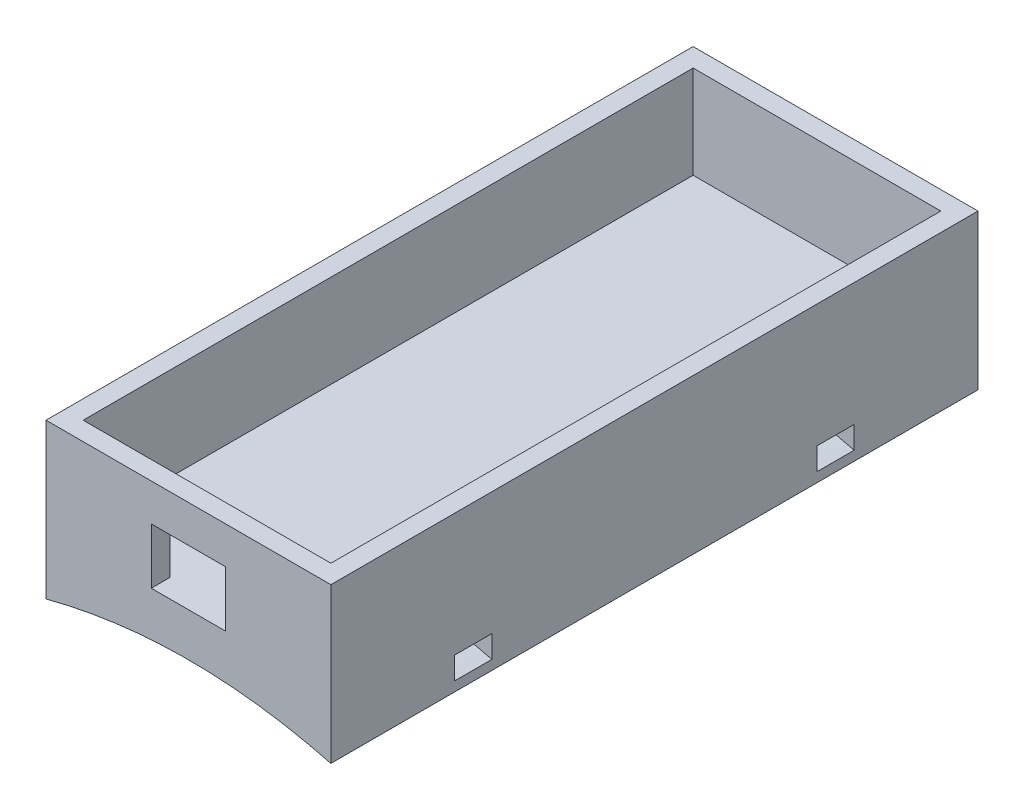
ISO-10303-21;
HEADER;
FILE_DESCRIPTION(('STEP AP214'),'2;1');
FILE_NAME('part.step','',(''),(''),'','','');
FILE_SCHEMA(('AUTOMOTIVE_DESIGN { 1 0 10303 214 1 1 1 1 }'));
ENDSEC;
DATA;
#1=APPLICATION_CONTEXT('core data for automotive mechanical design processes');
#2=APPLICATION_PROTOCOL_DEFINITION('international standard','automotive_design',2000,#1);
#3=PRODUCT_CONTEXT('',#1,'mechanical');
#4=PRODUCT('Part','Part','',(#3));
#5=PRODUCT_RELATED_PRODUCT_CATEGORY('part','',(#4));
#6=PRODUCT_DEFINITION_FORMATION('','',#4);
#7=PRODUCT_DEFINITION_CONTEXT('part definition',#1,'design');
#8=PRODUCT_DEFINITION('design','',#6,#7);
#9=PRODUCT_DEFINITION_SHAPE('','',#8);
#10=(LENGTH_UNIT() NAMED_UNIT(*) SI_UNIT(.MILLI.,.METRE.));
#11=(NAMED_UNIT(*) PLANE_ANGLE_UNIT() SI_UNIT($,.RADIAN.));
#12=(NAMED_UNIT(*) SI_UNIT($,.STERADIAN.) SOLID_ANGLE_UNIT());
#13=UNCERTAINTY_MEASURE_WITH_UNIT(LENGTH_MEASURE(1.E-05),#10,'distance_accuracy_value','');
#14=(GEOMETRIC_REPRESENTATION_CONTEXT(3) GLOBAL_UNCERTAINTY_ASSIGNED_CONTEXT((#13)) GLOBAL_UNIT_ASSIGNED_CONTEXT((#10,
#11,#12)) REPRESENTATION_CONTEXT('',''));
#15=CARTESIAN_POINT('',(0.,0.,0.));
#16=DIRECTION('',(0.,0.,1.));
#17=DIRECTION('',(1.,0.,0.));
#18=AXIS2_PLACEMENT_3D('',#15,#16,#17);
#19=CARTESIAN_POINT('',(-1.5,7.5,0.));
#20=DIRECTION('',(-1.,0.,0.));
#21=DIRECTION('',(0.,0.,1.));
#22=AXIS2_PLACEMENT_3D('',#19,#20,#21);
#23=PLANE('',#22);
#24=DIRECTION('',(0.,-1.,0.));
#25=VECTOR('',#24,1.);
#26=CARTESIAN_POINT('',(-1.5,7.5,-51.5));
#27=LINE('',#26,#25);
#28=CARTESIAN_POINT('',(-1.5,7.5,-51.5));
#29=VERTEX_POINT('',#28);
#30=CARTESIAN_POINT('',(-1.5,-5.,-51.5));
#31=VERTEX_POINT('',#30);
#32=EDGE_CURVE('E11',#29,#31,#27,.T.);
#33=ORIENTED_EDGE('',*,*,#32,.T.);
#34=DIRECTION('',(0.,0.,-1.));
#35=VECTOR('',#34,1.);
#36=CARTESIAN_POINT('',(-1.5,-5.,-51.5));
#37=LINE('',#36,#35);
#38=CARTESIAN_POINT('',(-1.5,-5.,0.750000000000001));
#39=VERTEX_POINT('',#38);
#40=EDGE_CURVE('E346',#39,#31,#37,.T.);
#41=ORIENTED_EDGE('',*,*,#40,.F.);
#42=DIRECTION('',(0.,-1.,0.));
#43=VECTOR('',#42,1.);
#44=CARTESIAN_POINT('',(-1.5,7.5,0.75));
#45=LINE('',#44,#43);
#46=CARTESIAN_POINT('',(-1.5,7.5,0.75));
#47=VERTEX_POINT('',#46);
#48=EDGE_CURVE('E51',#47,#39,#45,.T.);
#49=ORIENTED_EDGE('',*,*,#48,.F.);
#50=DIRECTION('',(0.,0.,-1.));
#51=VECTOR('',#50,1.);
#52=CARTESIAN_POINT('',(-1.5,7.5,0.));
#53=LINE('',#52,#51);
#54=EDGE_CURVE('E375',#47,#29,#53,.T.);
#55=ORIENTED_EDGE('',*,*,#54,.T.);
#56=EDGE_LOOP('',(#33,#41,#49,#55));
#57=FACE_BOUND('',#56,.T.);
#58=DIRECTION('',(0.,0.,-1.));
#59=VECTOR('',#58,1.);
#60=CARTESIAN_POINT('',(-1.49999999932235,-2.42062921537259,-38.5));
#61=LINE('',#60,#59);
#62=CARTESIAN_POINT('',(-1.49999999932235,-2.42062921537259,-38.5));
#63=VERTEX_POINT('',#62);
#64=CARTESIAN_POINT('',(-1.5,-2.4206292153726,-41.5));
#65=VERTEX_POINT('',#64);
#66=EDGE_CURVE('E694',#63,#65,#61,.T.);
#67=ORIENTED_EDGE('',*,*,#66,.F.);
#68=DIRECTION('',(2.62720537790411E-10,1.,0.));
#69=VECTOR('',#68,1.);
#70=CARTESIAN_POINT('',(-1.4999999986864,3.94080806340506E-10,-38.5));
#71=LINE('',#70,#69);
#72=CARTESIAN_POINT('',(-1.49999999979647,-4.22530562538644,-38.5));
#73=VERTEX_POINT('',#72);
#74=EDGE_CURVE('E264',#73,#63,#71,.T.);
#75=ORIENTED_EDGE('',*,*,#74,.F.);
#76=DIRECTION('',(0.,0.,-1.));
#77=VECTOR('',#76,1.);
#78=CARTESIAN_POINT('',(-1.49999999979647,-4.22530562538644,-38.5));
#79=LINE('',#78,#77);
#80=CARTESIAN_POINT('',(-1.49999999979647,-4.22530562538644,-41.5));
#81=VERTEX_POINT('',#80);
#82=EDGE_CURVE('E291',#73,#81,#79,.T.);
#83=ORIENTED_EDGE('',*,*,#82,.T.);
#84=DIRECTION('',(2.62720537790411E-10,1.,0.));
#85=VECTOR('',#84,1.);
#86=CARTESIAN_POINT('',(-1.4999999986864,3.94080806340506E-10,-41.5));
#87=LINE('',#86,#85);
#88=EDGE_CURVE('E673',#81,#65,#87,.T.);
#89=ORIENTED_EDGE('',*,*,#88,.T.);
#90=EDGE_LOOP('',(#67,#75,#83,#89));
#91=FACE_BOUND('',#90,.T.);
#92=DIRECTION('',(0.,0.,-1.));
#93=VECTOR('',#92,1.);
#94=CARTESIAN_POINT('',(-1.50000000404462,-4.22530560882838,-10.75));
#95=LINE('',#94,#93);
#96=CARTESIAN_POINT('',(-1.50000000404462,-4.22530560882838,-12.25));
#97=VERTEX_POINT('',#96);
#98=CARTESIAN_POINT('',(-1.5,-4.22530560882838,-9.25));
#99=VERTEX_POINT('',#98);
#100=EDGE_CURVE('E200',#97,#99,#95,.F.);
#101=ORIENTED_EDGE('',*,*,#100,.F.);
#102=DIRECTION('',(-2.61668753361445E-09,-1.,0.));
#103=VECTOR('',#102,1.);
#104=CARTESIAN_POINT('',(-1.49999999932235,-2.42062921537259,-12.25));
#105=LINE('',#104,#103);
#106=CARTESIAN_POINT('',(-1.49999999932234,-2.42062921537258,-12.25));
#107=VERTEX_POINT('',#106);
#108=EDGE_CURVE('E198',#107,#97,#105,.T.);
#109=ORIENTED_EDGE('',*,*,#108,.F.);
#110=DIRECTION('',(0.,0.,-1.));
#111=VECTOR('',#110,1.);
#112=CARTESIAN_POINT('',(-1.49999999932234,-2.42062921537258,-10.75));
#113=LINE('',#112,#111);
#114=CARTESIAN_POINT('',(-1.49999999932234,-2.42062921537258,-9.25000000000001));
#115=VERTEX_POINT('',#114);
#116=EDGE_CURVE('E180',#107,#115,#113,.F.);
#117=ORIENTED_EDGE('',*,*,#116,.T.);
#118=DIRECTION('',(-2.61668753361445E-09,-1.,0.));
#119=VECTOR('',#118,1.);
#120=CARTESIAN_POINT('',(-1.49999999932235,-2.42062921537259,-9.25));
#121=LINE('',#120,#119);
#122=EDGE_CURVE('E186',#115,#99,#121,.T.);
#123=ORIENTED_EDGE('',*,*,#122,.T.);
#124=EDGE_LOOP('',(#101,#109,#117,#123));
#125=FACE_BOUND('',#124,.T.);
#126=ADVANCED_FACE('F41',(#57,#91,#125),#23,.T.);
#127=CARTESIAN_POINT('',(21.5,7.5,0.));
#128=DIRECTION('',(1.,0.,0.));
#129=DIRECTION('',(0.,0.,-1.));
#130=AXIS2_PLACEMENT_3D('',#127,#128,#129);
#131=PLANE('',#130);
#132=DIRECTION('',(0.,-1.,0.));
#133=VECTOR('',#132,1.);
#134=CARTESIAN_POINT('',(21.5,7.5,0.75));
#135=LINE('',#134,#133);
#136=CARTESIAN_POINT('',(21.5,7.5,0.75));
#137=VERTEX_POINT('',#136);
#138=CARTESIAN_POINT('',(21.5,-5.,0.750000000000001));
#139=VERTEX_POINT('',#138);
#140=EDGE_CURVE('E405',#137,#139,#135,.T.);
#141=ORIENTED_EDGE('',*,*,#140,.T.);
#142=DIRECTION('',(0.,0.,1.));
#143=VECTOR('',#142,1.);
#144=CARTESIAN_POINT('',(21.5,-5.,-51.5));
#145=LINE('',#144,#143);
#146=CARTESIAN_POINT('',(21.5,-5.,-51.5));
#147=VERTEX_POINT('',#146);
#148=EDGE_CURVE('E422',#147,#139,#145,.T.);
#149=ORIENTED_EDGE('',*,*,#148,.F.);
#150=DIRECTION('',(0.,-1.,0.));
#151=VECTOR('',#150,1.);
#152=CARTESIAN_POINT('',(21.5,7.5,-51.5));
#153=LINE('',#152,#151);
#154=CARTESIAN_POINT('',(21.5,7.5,-51.5));
#155=VERTEX_POINT('',#154);
#156=EDGE_CURVE('E402',#155,#147,#153,.T.);
#157=ORIENTED_EDGE('',*,*,#156,.F.);
#158=DIRECTION('',(0.,0.,1.));
#159=VECTOR('',#158,1.);
#160=CARTESIAN_POINT('',(21.5,7.5,0.));
#161=LINE('',#160,#159);
#162=EDGE_CURVE('E382',#155,#137,#161,.T.);
#163=ORIENTED_EDGE('',*,*,#162,.T.);
#164=EDGE_LOOP('',(#141,#149,#157,#163));
#165=FACE_BOUND('',#164,.T.);
#166=DIRECTION('',(0.,0.,-1.));
#167=VECTOR('',#166,1.);
#168=CARTESIAN_POINT('',(21.4999999997962,-4.22530562538759,-38.5));
#169=LINE('',#168,#167);
#170=CARTESIAN_POINT('',(21.4999999997962,-4.22530562538759,-38.5));
#171=VERTEX_POINT('',#170);
#172=CARTESIAN_POINT('',(21.5,-4.22530562538759,-41.5));
#173=VERTEX_POINT('',#172);
#174=EDGE_CURVE('E302',#171,#173,#169,.T.);
#175=ORIENTED_EDGE('',*,*,#174,.F.);
#176=DIRECTION('',(-2.63069752866521E-10,1.,0.));
#177=VECTOR('',#176,1.);
#178=CARTESIAN_POINT('',(21.4999999986847,5.65599968628418E-09,-38.5));
#179=LINE('',#178,#177);
#180=CARTESIAN_POINT('',(21.4999999993214,-2.42062921537248,-38.5));
#181=VERTEX_POINT('',#180);
#182=EDGE_CURVE('E699',#171,#181,#179,.T.);
#183=ORIENTED_EDGE('',*,*,#182,.T.);
#184=DIRECTION('',(0.,0.,-1.));
#185=VECTOR('',#184,1.);
#186=CARTESIAN_POINT('',(21.4999999993214,-2.42062921537248,-38.5));
#187=LINE('',#186,#185);
#188=CARTESIAN_POINT('',(21.4999999993214,-2.42062921537248,-41.5));
#189=VERTEX_POINT('',#188);
#190=EDGE_CURVE('E681',#181,#189,#187,.T.);
#191=ORIENTED_EDGE('',*,*,#190,.T.);
#192=DIRECTION('',(-2.63069752866521E-10,1.,0.));
#193=VECTOR('',#192,1.);
#194=CARTESIAN_POINT('',(21.4999999986847,5.65599968628418E-09,-41.5));
#195=LINE('',#194,#193);
#196=EDGE_CURVE('E265',#173,#189,#195,.T.);
#197=ORIENTED_EDGE('',*,*,#196,.F.);
#198=EDGE_LOOP('',(#175,#183,#191,#197));
#199=FACE_BOUND('',#198,.T.);
#200=DIRECTION('',(0.,0.,-1.));
#201=VECTOR('',#200,1.);
#202=CARTESIAN_POINT('',(21.4999999993214,-2.42062921537248,-10.75));
#203=LINE('',#202,#201);
#204=CARTESIAN_POINT('',(21.4999999993214,-2.42062921537248,-12.25));
#205=VERTEX_POINT('',#204);
#206=CARTESIAN_POINT('',(21.5,-2.42062921537248,-9.25));
#207=VERTEX_POINT('',#206);
#208=EDGE_CURVE('E183',#205,#207,#203,.F.);
#209=ORIENTED_EDGE('',*,*,#208,.F.);
#210=DIRECTION('',(-2.61722414471187E-09,1.,0.));
#211=VECTOR('',#210,1.);
#212=CARTESIAN_POINT('',(21.5000000040447,-4.22530560882845,-12.25));
#213=LINE('',#212,#211);
#214=CARTESIAN_POINT('',(21.5000000040447,-4.22530560882845,-12.25));
#215=VERTEX_POINT('',#214);
#216=EDGE_CURVE('E221',#215,#205,#213,.T.);
#217=ORIENTED_EDGE('',*,*,#216,.F.);
#218=DIRECTION('',(0.,0.,-1.));
#219=VECTOR('',#218,1.);
#220=CARTESIAN_POINT('',(21.5000000040447,-4.22530560882845,-10.75));
#221=LINE('',#220,#219);
#222=CARTESIAN_POINT('',(21.5000000040447,-4.22530560882845,-9.25000000000001));
#223=VERTEX_POINT('',#222);
#224=EDGE_CURVE('E206',#215,#223,#221,.F.);
#225=ORIENTED_EDGE('',*,*,#224,.T.);
#226=DIRECTION('',(-2.61722414471187E-09,1.,0.));
#227=VECTOR('',#226,1.);
#228=CARTESIAN_POINT('',(21.5000000040447,-4.22530560882845,-9.25));
#229=LINE('',#228,#227);
#230=EDGE_CURVE('E187',#223,#207,#229,.T.);
#231=ORIENTED_EDGE('',*,*,#230,.T.);
#232=EDGE_LOOP('',(#209,#217,#225,#231));
#233=FACE_BOUND('',#232,.T.);
#234=ADVANCED_FACE('F452',(#165,#199,#233),#131,.T.);
#235=CARTESIAN_POINT('',(0.,7.5,0.75));
#236=DIRECTION('',(0.,0.,-1.));
#237=DIRECTION('',(-1.,0.,0.));
#238=AXIS2_PLACEMENT_3D('',#235,#236,#237);
#239=PLANE('',#238);
#240=ORIENTED_EDGE('',*,*,#48,.T.);
#241=CARTESIAN_POINT('',(-1.5,-5.,0.750000000000001));
#242=CARTESIAN_POINT('',(10.,-2.,0.750000000000001));
#243=CARTESIAN_POINT('',(21.5,-5.,0.750000000000001));
#244=B_SPLINE_CURVE_WITH_KNOTS('',2,(#241,#242,#243),.UNSPECIFIED.,.F.,.F.,(3,3),(0.,1.),.UNSPECIFIED.);
#245=EDGE_CURVE('E301',#39,#139,#244,.T.);
#246=ORIENTED_EDGE('',*,*,#245,.T.);
#247=ORIENTED_EDGE('',*,*,#140,.F.);
#248=DIRECTION('',(1.,0.,0.));
#249=VECTOR('',#248,1.);
#250=CARTESIAN_POINT('',(0.,7.5,0.75));
#251=LINE('',#250,#249);
#252=EDGE_CURVE('E379',#47,#137,#251,.T.);
#253=ORIENTED_EDGE('',*,*,#252,.F.);
#254=EDGE_LOOP('',(#240,#246,#247,#253));
#255=FACE_BOUND('',#254,.T.);
#256=DIRECTION('',(-1.,0.,0.));
#257=VECTOR('',#256,1.);
#258=CARTESIAN_POINT('',(0.,4.5,0.75));
#259=LINE('',#258,#257);
#260=CARTESIAN_POINT('',(13.,4.5,0.75));
#261=VERTEX_POINT('',#260);
#262=CARTESIAN_POINT('',(7.,4.5,0.75));
#263=VERTEX_POINT('',#262);
#264=EDGE_CURVE('E314',#261,#263,#259,.T.);
#265=ORIENTED_EDGE('',*,*,#264,.F.);
#266=DIRECTION('',(0.,-1.,0.));
#267=VECTOR('',#266,1.);
#268=CARTESIAN_POINT('',(13.,0.,0.75));
#269=LINE('',#268,#267);
#270=CARTESIAN_POINT('',(13.,0.,0.75));
#271=VERTEX_POINT('',#270);
#272=EDGE_CURVE('E320',#261,#271,#269,.T.);
#273=ORIENTED_EDGE('',*,*,#272,.T.);
#274=DIRECTION('',(-1.,0.,0.));
#275=VECTOR('',#274,1.);
#276=CARTESIAN_POINT('',(0.,0.,0.75));
#277=LINE('',#276,#275);
#278=CARTESIAN_POINT('',(7.,0.,0.75));
#279=VERTEX_POINT('',#278);
#280=EDGE_CURVE('E325',#271,#279,#277,.T.);
#281=ORIENTED_EDGE('',*,*,#280,.T.);
#282=DIRECTION('',(0.,-1.,0.));
#283=VECTOR('',#282,1.);
#284=CARTESIAN_POINT('',(7.,0.,0.75));
#285=LINE('',#284,#283);
#286=EDGE_CURVE('E329',#263,#279,#285,.T.);
#287=ORIENTED_EDGE('',*,*,#286,.F.);
#288=EDGE_LOOP('',(#265,#273,#281,#287));
#289=FACE_BOUND('',#288,.T.);
#290=ADVANCED_FACE('F455',(#255,#289),#239,.F.);
#291=CARTESIAN_POINT('',(0.,7.5,-0.75));
#292=DIRECTION('',(0.,0.,-1.));
#293=DIRECTION('',(-1.,0.,0.));
#294=AXIS2_PLACEMENT_3D('',#291,#292,#293);
#295=PLANE('',#294);
#296=DIRECTION('',(-1.,0.,0.));
#297=VECTOR('',#296,1.);
#298=CARTESIAN_POINT('',(0.,4.5,-0.75));
#299=LINE('',#298,#297);
#300=CARTESIAN_POINT('',(13.,4.5,-0.75));
#301=VERTEX_POINT('',#300);
#302=CARTESIAN_POINT('',(7.,4.5,-0.75));
#303=VERTEX_POINT('',#302);
#304=EDGE_CURVE('E309',#301,#303,#299,.T.);
#305=ORIENTED_EDGE('',*,*,#304,.T.);
#306=DIRECTION('',(0.,-1.,0.));
#307=VECTOR('',#306,1.);
#308=CARTESIAN_POINT('',(7.,0.,-0.75));
#309=LINE('',#308,#307);
#310=CARTESIAN_POINT('',(7.,0.,-0.75));
#311=VERTEX_POINT('',#310);
#312=EDGE_CURVE('E321',#303,#311,#309,.T.);
#313=ORIENTED_EDGE('',*,*,#312,.T.);
#314=DIRECTION('',(1.,0.,0.));
#315=VECTOR('',#314,1.);
#316=CARTESIAN_POINT('',(0.,0.,-0.75));
#317=LINE('',#316,#315);
#318=CARTESIAN_POINT('',(0.,0.,-0.75));
#319=VERTEX_POINT('',#318);
#320=EDGE_CURVE('E387',#319,#311,#317,.T.);
#321=ORIENTED_EDGE('',*,*,#320,.F.);
#322=DIRECTION('',(0.,-1.,0.));
#323=VECTOR('',#322,1.);
#324=CARTESIAN_POINT('',(0.,7.5,-0.75));
#325=LINE('',#324,#323);
#326=CARTESIAN_POINT('',(0.,7.5,-0.75));
#327=VERTEX_POINT('',#326);
#328=EDGE_CURVE('E406',#327,#319,#325,.T.);
#329=ORIENTED_EDGE('',*,*,#328,.F.);
#330=DIRECTION('',(1.,0.,0.));
#331=VECTOR('',#330,1.);
#332=CARTESIAN_POINT('',(0.,7.5,-0.75));
#333=LINE('',#332,#331);
#334=CARTESIAN_POINT('',(20.,7.5,-0.75));
#335=VERTEX_POINT('',#334);
#336=EDGE_CURVE('E356',#327,#335,#333,.T.);
#337=ORIENTED_EDGE('',*,*,#336,.T.);
#338=DIRECTION('',(0.,-1.,0.));
#339=VECTOR('',#338,1.);
#340=CARTESIAN_POINT('',(20.,7.5,-0.75));
#341=LINE('',#340,#339);
#342=CARTESIAN_POINT('',(20.,0.,-0.75));
#343=VERTEX_POINT('',#342);
#344=EDGE_CURVE('E386',#335,#343,#341,.T.);
#345=ORIENTED_EDGE('',*,*,#344,.T.);
#346=CARTESIAN_POINT('',(13.,0.,-0.75));
#347=VERTEX_POINT('',#346);
#348=EDGE_CURVE('E392',#347,#343,#317,.T.);
#349=ORIENTED_EDGE('',*,*,#348,.F.);
#350=DIRECTION('',(0.,-1.,0.));
#351=VECTOR('',#350,1.);
#352=CARTESIAN_POINT('',(13.,0.,-0.75));
#353=LINE('',#352,#351);
#354=EDGE_CURVE('E336',#301,#347,#353,.T.);
#355=ORIENTED_EDGE('',*,*,#354,.F.);
#356=EDGE_LOOP('',(#305,#313,#321,#329,#337,#345,#349,#355));
#357=FACE_BOUND('',#356,.T.);
#358=ADVANCED_FACE('F43',(#357),#295,.T.);
#359=CARTESIAN_POINT('',(0.,7.5,-51.5));
#360=DIRECTION('',(0.,0.,-1.));
#361=DIRECTION('',(-1.,0.,0.));
#362=AXIS2_PLACEMENT_3D('',#359,#360,#361);
#363=PLANE('',#362);
#364=CARTESIAN_POINT('',(-1.5,-5.,-51.5));
#365=CARTESIAN_POINT('',(10.,-2.,-51.5));
#366=CARTESIAN_POINT('',(21.5,-5.,-51.5));
#367=B_SPLINE_CURVE_WITH_KNOTS('',2,(#364,#365,#366),.UNSPECIFIED.,.F.,.F.,(3,3),(0.,1.),.UNSPECIFIED.);
#368=EDGE_CURVE('E293',#31,#147,#367,.T.);
#369=ORIENTED_EDGE('',*,*,#368,.F.);
#370=ORIENTED_EDGE('',*,*,#32,.F.);
#371=DIRECTION('',(1.,0.,0.));
#372=VECTOR('',#371,1.);
#373=CARTESIAN_POINT('',(0.,7.5,-51.5));
#374=LINE('',#373,#372);
#375=EDGE_CURVE('E371',#29,#155,#374,.T.);
#376=ORIENTED_EDGE('',*,*,#375,.T.);
#377=ORIENTED_EDGE('',*,*,#156,.T.);
#378=EDGE_LOOP('',(#369,#370,#376,#377));
#379=FACE_BOUND('',#378,.T.);
#380=ADVANCED_FACE('F441',(#379),#363,.T.);
#381=CARTESIAN_POINT('',(0.,7.5,0.));
#382=DIRECTION('',(-1.,0.,0.));
#383=DIRECTION('',(0.,0.,1.));
#384=AXIS2_PLACEMENT_3D('',#381,#382,#383);
#385=PLANE('',#384);
#386=DIRECTION('',(0.,0.,-1.));
#387=VECTOR('',#386,1.);
#388=CARTESIAN_POINT('',(0.,0.,0.));
#389=LINE('',#388,#387);
#390=CARTESIAN_POINT('',(0.,0.,-50.));
#391=VERTEX_POINT('',#390);
#392=EDGE_CURVE('E391',#319,#391,#389,.T.);
#393=ORIENTED_EDGE('',*,*,#392,.T.);
#394=DIRECTION('',(0.,-1.,0.));
#395=VECTOR('',#394,1.);
#396=CARTESIAN_POINT('',(0.,7.5,-50.));
#397=LINE('',#396,#395);
#398=CARTESIAN_POINT('',(0.,7.5,-50.));
#399=VERTEX_POINT('',#398);
#400=EDGE_CURVE('E415',#399,#391,#397,.T.);
#401=ORIENTED_EDGE('',*,*,#400,.F.);
#402=DIRECTION('',(0.,0.,-1.));
#403=VECTOR('',#402,1.);
#404=CARTESIAN_POINT('',(0.,7.5,0.));
#405=LINE('',#404,#403);
#406=EDGE_CURVE('E360',#327,#399,#405,.T.);
#407=ORIENTED_EDGE('',*,*,#406,.F.);
#408=ORIENTED_EDGE('',*,*,#328,.T.);
#409=EDGE_LOOP('',(#393,#401,#407,#408));
#410=FACE_BOUND('',#409,.T.);
#411=ADVANCED_FACE('F476',(#410),#385,.F.);
#412=CARTESIAN_POINT('',(0.,7.5,-50.));
#413=DIRECTION('',(0.,0.,-1.));
#414=DIRECTION('',(-1.,0.,0.));
#415=AXIS2_PLACEMENT_3D('',#412,#413,#414);
#416=PLANE('',#415);
#417=DIRECTION('',(1.,0.,0.));
#418=VECTOR('',#417,1.);
#419=CARTESIAN_POINT('',(0.,0.,-50.));
#420=LINE('',#419,#418);
#421=CARTESIAN_POINT('',(20.,0.,-50.));
#422=VERTEX_POINT('',#421);
#423=EDGE_CURVE('E396',#391,#422,#420,.T.);
#424=ORIENTED_EDGE('',*,*,#423,.T.);
#425=DIRECTION('',(0.,-1.,0.));
#426=VECTOR('',#425,1.);
#427=CARTESIAN_POINT('',(20.,7.5,-50.));
#428=LINE('',#427,#426);
#429=CARTESIAN_POINT('',(20.,7.5,-50.));
#430=VERTEX_POINT('',#429);
#431=EDGE_CURVE('E411',#430,#422,#428,.T.);
#432=ORIENTED_EDGE('',*,*,#431,.F.);
#433=DIRECTION('',(1.,0.,0.));
#434=VECTOR('',#433,1.);
#435=CARTESIAN_POINT('',(0.,7.5,-50.));
#436=LINE('',#435,#434);
#437=EDGE_CURVE('E364',#399,#430,#436,.T.);
#438=ORIENTED_EDGE('',*,*,#437,.F.);
#439=ORIENTED_EDGE('',*,*,#400,.T.);
#440=EDGE_LOOP('',(#424,#432,#438,#439));
#441=FACE_BOUND('',#440,.T.);
#442=ADVANCED_FACE('F505',(#441),#416,.F.);
#443=CARTESIAN_POINT('',(20.,7.5,0.));
#444=DIRECTION('',(-1.,0.,0.));
#445=DIRECTION('',(0.,0.,1.));
#446=AXIS2_PLACEMENT_3D('',#443,#444,#445);
#447=PLANE('',#446);
#448=DIRECTION('',(0.,0.,-1.));
#449=VECTOR('',#448,1.);
#450=CARTESIAN_POINT('',(20.,0.,0.));
#451=LINE('',#450,#449);
#452=EDGE_CURVE('E361',#343,#422,#451,.T.);
#453=ORIENTED_EDGE('',*,*,#452,.F.);
#454=ORIENTED_EDGE('',*,*,#344,.F.);
#455=DIRECTION('',(0.,0.,-1.));
#456=VECTOR('',#455,1.);
#457=CARTESIAN_POINT('',(20.,7.5,0.));
#458=LINE('',#457,#456);
#459=EDGE_CURVE('E367',#335,#430,#458,.T.);
#460=ORIENTED_EDGE('',*,*,#459,.T.);
#461=ORIENTED_EDGE('',*,*,#431,.T.);
#462=EDGE_LOOP('',(#453,#454,#460,#461));
#463=FACE_BOUND('',#462,.T.);
#464=ADVANCED_FACE('F485',(#463),#447,.T.);
#465=CARTESIAN_POINT('',(0.,7.5,0.));
#466=DIRECTION('',(0.,1.,0.));
#467=DIRECTION('',(0.,0.,1.));
#468=AXIS2_PLACEMENT_3D('',#465,#466,#467);
#469=PLANE('',#468);
#470=ORIENTED_EDGE('',*,*,#336,.F.);
#471=ORIENTED_EDGE('',*,*,#406,.T.);
#472=ORIENTED_EDGE('',*,*,#437,.T.);
#473=ORIENTED_EDGE('',*,*,#459,.F.);
#474=EDGE_LOOP('',(#470,#471,#472,#473));
#475=FACE_BOUND('',#474,.T.);
#476=ORIENTED_EDGE('',*,*,#375,.F.);
#477=ORIENTED_EDGE('',*,*,#54,.F.);
#478=ORIENTED_EDGE('',*,*,#252,.T.);
#479=ORIENTED_EDGE('',*,*,#162,.F.);
#480=EDGE_LOOP('',(#476,#477,#478,#479));
#481=FACE_BOUND('',#480,.T.);
#482=ADVANCED_FACE('F448',(#475,#481),#469,.T.);
#483=CARTESIAN_POINT('',(0.,0.,0.));
#484=DIRECTION('',(0.,1.,0.));
#485=DIRECTION('',(0.,0.,1.));
#486=AXIS2_PLACEMENT_3D('',#483,#484,#485);
#487=PLANE('',#486);
#488=ORIENTED_EDGE('',*,*,#392,.F.);
#489=ORIENTED_EDGE('',*,*,#320,.T.);
#490=DIRECTION('',(0.,0.,-1.));
#491=VECTOR('',#490,1.);
#492=CARTESIAN_POINT('',(7.,0.,0.75));
#493=LINE('',#492,#491);
#494=EDGE_CURVE('E347',#279,#311,#493,.T.);
#495=ORIENTED_EDGE('',*,*,#494,.F.);
#496=ORIENTED_EDGE('',*,*,#280,.F.);
#497=DIRECTION('',(0.,0.,-1.));
#498=VECTOR('',#497,1.);
#499=CARTESIAN_POINT('',(13.,0.,0.75));
#500=LINE('',#499,#498);
#501=EDGE_CURVE('E350',#271,#347,#500,.T.);
#502=ORIENTED_EDGE('',*,*,#501,.T.);
#503=ORIENTED_EDGE('',*,*,#348,.T.);
#504=ORIENTED_EDGE('',*,*,#452,.T.);
#505=ORIENTED_EDGE('',*,*,#423,.F.);
#506=EDGE_LOOP('',(#488,#489,#495,#496,#502,#503,#504,#505));
#507=FACE_BOUND('',#506,.T.);
#508=ADVANCED_FACE('F472',(#507),#487,.T.);
#509=CARTESIAN_POINT('',(0.,4.5,0.75));
#510=DIRECTION('',(0.,-1.,0.));
#511=DIRECTION('',(0.,0.,-1.));
#512=AXIS2_PLACEMENT_3D('',#509,#510,#511);
#513=PLANE('',#512);
#514=ORIENTED_EDGE('',*,*,#304,.F.);
#515=DIRECTION('',(0.,0.,-1.));
#516=VECTOR('',#515,1.);
#517=CARTESIAN_POINT('',(13.,4.5,0.75));
#518=LINE('',#517,#516);
#519=EDGE_CURVE('E332',#261,#301,#518,.T.);
#520=ORIENTED_EDGE('',*,*,#519,.F.);
#521=ORIENTED_EDGE('',*,*,#264,.T.);
#522=DIRECTION('',(0.,0.,-1.));
#523=VECTOR('',#522,1.);
#524=CARTESIAN_POINT('',(7.,4.5,0.75));
#525=LINE('',#524,#523);
#526=EDGE_CURVE('E342',#263,#303,#525,.T.);
#527=ORIENTED_EDGE('',*,*,#526,.T.);
#528=EDGE_LOOP('',(#514,#520,#521,#527));
#529=FACE_BOUND('',#528,.T.);
#530=ADVANCED_FACE('F465',(#529),#513,.T.);
#531=CARTESIAN_POINT('',(7.,0.,0.75));
#532=DIRECTION('',(1.,0.,0.));
#533=DIRECTION('',(0.,0.,-1.));
#534=AXIS2_PLACEMENT_3D('',#531,#532,#533);
#535=PLANE('',#534);
#536=ORIENTED_EDGE('',*,*,#312,.F.);
#537=ORIENTED_EDGE('',*,*,#526,.F.);
#538=ORIENTED_EDGE('',*,*,#286,.T.);
#539=ORIENTED_EDGE('',*,*,#494,.T.);
#540=EDGE_LOOP('',(#536,#537,#538,#539));
#541=FACE_BOUND('',#540,.T.);
#542=ADVANCED_FACE('F284',(#541),#535,.T.);
#543=CARTESIAN_POINT('',(13.,0.,0.75));
#544=DIRECTION('',(1.,0.,0.));
#545=DIRECTION('',(0.,0.,-1.));
#546=AXIS2_PLACEMENT_3D('',#543,#544,#545);
#547=PLANE('',#546);
#548=ORIENTED_EDGE('',*,*,#354,.T.);
#549=ORIENTED_EDGE('',*,*,#501,.F.);
#550=ORIENTED_EDGE('',*,*,#272,.F.);
#551=ORIENTED_EDGE('',*,*,#519,.T.);
#552=EDGE_LOOP('',(#548,#549,#550,#551));
#553=FACE_BOUND('',#552,.T.);
#554=ADVANCED_FACE('F282',(#553),#547,.F.);
#555=CARTESIAN_POINT('',(-1.5,-5.,21.));
#556=CARTESIAN_POINT('',(10.,-2.,21.));
#557=CARTESIAN_POINT('',(21.5,-5.,21.));
#558=B_SPLINE_CURVE_WITH_KNOTS('',2,(#555,#556,#557),.UNSPECIFIED.,.F.,.F.,(3,3),(0.,1.),.UNSPECIFIED.);
#559=DIRECTION('',(0.,0.,-1.));
#560=VECTOR('',#559,1.);
#561=SURFACE_OF_LINEAR_EXTRUSION('',#558,#560);
#562=ORIENTED_EDGE('',*,*,#40,.T.);
#563=ORIENTED_EDGE('',*,*,#368,.T.);
#564=ORIENTED_EDGE('',*,*,#148,.T.);
#565=ORIENTED_EDGE('',*,*,#245,.F.);
#566=EDGE_LOOP('',(#562,#563,#564,#565));
#567=FACE_BOUND('',#566,.T.);
#568=ADVANCED_FACE('F276',(#567),#561,.F.);
#569=CARTESIAN_POINT('',(-1.68931642286076,-4.27428704567651,-38.5));
#570=CARTESIAN_POINT('',(-0.723177072021427,-4.02225069328363,-38.5));
#571=CARTESIAN_POINT('',(1.23384065931098,-3.57518255436494,-38.5));
#572=CARTESIAN_POINT('',(5.12508120919202,-2.94122991223732,-38.5));
#573=CARTESIAN_POINT('',(10.0000000000095,-2.62251339179796,-38.5));
#574=CARTESIAN_POINT('',(14.8749187908227,-2.94122991223914,-38.5));
#575=CARTESIAN_POINT('',(18.7661593407068,-3.57518255436815,-38.5));
#576=CARTESIAN_POINT('',(20.7231770720375,-4.02225069328753,-38.5));
#577=CARTESIAN_POINT('',(21.6893164228766,-4.27428704568068,-38.5));
#578=B_SPLINE_CURVE_WITH_KNOTS('',3,(#569,#570,#571,#572,#573,#574,#575,#576,#577),
.UNSPECIFIED.,.F.,.F.,(4,1,1,1,1,1,4),(0.499387627564304,0.499540720673228,0.499693813782152,
0.5,0.500306186217849,0.500459279326773,0.500612372435697),.UNSPECIFIED.);
#579=DIRECTION('',(0.,0.,-1.));
#580=VECTOR('',#579,1.);
#581=SURFACE_OF_LINEAR_EXTRUSION('',#578,#580);
#582=CARTESIAN_POINT('',(-1.68931642286076,-4.27428704567651,-41.5));
#583=CARTESIAN_POINT('',(-0.723177072021427,-4.02225069328363,-41.5));
#584=CARTESIAN_POINT('',(1.23384065931098,-3.57518255436494,-41.5));
#585=CARTESIAN_POINT('',(5.12508120919202,-2.94122991223732,-41.5));
#586=CARTESIAN_POINT('',(10.0000000000095,-2.62251339179796,-41.5));
#587=CARTESIAN_POINT('',(14.8749187908227,-2.94122991223914,-41.5));
#588=CARTESIAN_POINT('',(18.7661593407068,-3.57518255436815,-41.5));
#589=CARTESIAN_POINT('',(20.7231770720375,-4.02225069328753,-41.5));
#590=CARTESIAN_POINT('',(21.6893164228766,-4.27428704568068,-41.5));
#591=B_SPLINE_CURVE_WITH_KNOTS('',3,(#582,#583,#584,#585,#586,#587,#588,#589,#590),
.UNSPECIFIED.,.F.,.F.,(4,1,1,1,1,1,4),(0.499387627564304,0.499540720673228,0.499693813782152,
0.5,0.500306186217849,0.500459279326773,0.500612372435697),.UNSPECIFIED.);
#592=EDGE_CURVE('E204',#81,#173,#591,.T.);
#593=ORIENTED_EDGE('',*,*,#592,.F.);
#594=ORIENTED_EDGE('',*,*,#82,.F.);
#595=EDGE_CURVE('E257',#73,#171,#578,.T.);
#596=ORIENTED_EDGE('',*,*,#595,.T.);
#597=ORIENTED_EDGE('',*,*,#174,.T.);
#598=EDGE_LOOP('',(#593,#594,#596,#597));
#599=FACE_BOUND('',#598,.T.);
#600=ADVANCED_FACE('F271',(#599),#581,.T.);
#601=CARTESIAN_POINT('',(-2.13106388362616,-2.58092188713731,-38.5));
#602=CARTESIAN_POINT('',(-1.12995030631539,-2.31976182349139,-38.5));
#603=CARTESIAN_POINT('',(0.89692026111759,-1.85672698809461,-38.5));
#604=CARTESIAN_POINT('',(4.93501229421644,-1.19870469690264,-38.5));
#605=CARTESIAN_POINT('',(10.0000000000262,-0.867469996862146,-38.5));
#606=CARTESIAN_POINT('',(15.0649877058316,-1.19870469690803,-38.5));
#607=CARTESIAN_POINT('',(19.1030797389329,-1.85672698810423,-38.5));
#608=CARTESIAN_POINT('',(21.1299503063639,-2.3197618235031,-38.5));
#609=CARTESIAN_POINT('',(22.1310638836742,-2.58092188715002,-38.5));
#610=B_SPLINE_CURVE_WITH_KNOTS('',3,(#601,#602,#603,#604,#605,#606,#607,#608,#609),
.UNSPECIFIED.,.F.,.F.,(4,1,1,1,1,1,4),(0.499387627564304,0.499540720673228,0.499693813782152,
0.5,0.500306186217849,0.500459279326773,0.500612372435697),.UNSPECIFIED.);
#611=DIRECTION('',(0.,0.,-1.));
#612=VECTOR('',#611,1.);
#613=SURFACE_OF_LINEAR_EXTRUSION('',#610,#612);
#614=CARTESIAN_POINT('',(-2.13106388362616,-2.58092188713731,-41.5));
#615=CARTESIAN_POINT('',(-1.12995030631539,-2.31976182349139,-41.5));
#616=CARTESIAN_POINT('',(0.89692026111759,-1.85672698809461,-41.5));
#617=CARTESIAN_POINT('',(4.93501229421644,-1.19870469690264,-41.5));
#618=CARTESIAN_POINT('',(10.0000000000262,-0.867469996862146,-41.5));
#619=CARTESIAN_POINT('',(15.0649877058316,-1.19870469690803,-41.5));
#620=CARTESIAN_POINT('',(19.1030797389329,-1.85672698810423,-41.5));
#621=CARTESIAN_POINT('',(21.1299503063639,-2.3197618235031,-41.5));
#622=CARTESIAN_POINT('',(22.1310638836742,-2.58092188715002,-41.5));
#623=B_SPLINE_CURVE_WITH_KNOTS('',3,(#614,#615,#616,#617,#618,#619,#620,#621,#622),
.UNSPECIFIED.,.F.,.F.,(4,1,1,1,1,1,4),(0.499387627564304,0.499540720673228,0.499693813782152,
0.5,0.500306186217849,0.500459279326773,0.500612372435697),.UNSPECIFIED.);
#624=EDGE_CURVE('E685',#65,#189,#623,.T.);
#625=ORIENTED_EDGE('',*,*,#624,.T.);
#626=ORIENTED_EDGE('',*,*,#190,.F.);
#627=EDGE_CURVE('E702',#63,#181,#610,.T.);
#628=ORIENTED_EDGE('',*,*,#627,.F.);
#629=ORIENTED_EDGE('',*,*,#66,.T.);
#630=EDGE_LOOP('',(#625,#626,#628,#629));
#631=FACE_BOUND('',#630,.T.);
#632=ADVANCED_FACE('F275',(#631),#613,.F.);
#633=CARTESIAN_POINT('',(0.,0.,-38.5));
#634=DIRECTION('',(0.,0.,-1.));
#635=DIRECTION('',(-1.,0.,0.));
#636=AXIS2_PLACEMENT_3D('',#633,#634,#635);
#637=PLANE('',#636);
#638=ORIENTED_EDGE('',*,*,#595,.F.);
#639=ORIENTED_EDGE('',*,*,#74,.T.);
#640=ORIENTED_EDGE('',*,*,#627,.T.);
#641=ORIENTED_EDGE('',*,*,#182,.F.);
#642=EDGE_LOOP('',(#638,#639,#640,#641));
#643=FACE_BOUND('',#642,.T.);
#644=ADVANCED_FACE('F583',(#643),#637,.T.);
#645=CARTESIAN_POINT('',(0.,0.,-41.5));
#646=DIRECTION('',(0.,0.,-1.));
#647=DIRECTION('',(-1.,0.,0.));
#648=AXIS2_PLACEMENT_3D('',#645,#646,#647);
#649=PLANE('',#648);
#650=ORIENTED_EDGE('',*,*,#592,.T.);
#651=ORIENTED_EDGE('',*,*,#196,.T.);
#652=ORIENTED_EDGE('',*,*,#624,.F.);
#653=ORIENTED_EDGE('',*,*,#88,.F.);
#654=EDGE_LOOP('',(#650,#651,#652,#653));
#655=FACE_BOUND('',#654,.T.);
#656=ADVANCED_FACE('F592',(#655),#649,.F.);
#657=CARTESIAN_POINT('',(-1.68931642286076,-4.27428704567651,-38.5));
#658=CARTESIAN_POINT('',(-0.723177072021427,-4.02225069328363,-38.5));
#659=CARTESIAN_POINT('',(1.23384065931098,-3.57518255436494,-38.5));
#660=CARTESIAN_POINT('',(5.12508120919202,-2.94122991223732,-38.5));
#661=CARTESIAN_POINT('',(10.0000000000095,-2.62251339179796,-38.5));
#662=CARTESIAN_POINT('',(14.8749187908227,-2.94122991223914,-38.5));
#663=CARTESIAN_POINT('',(18.7661593407068,-3.57518255436815,-38.5));
#664=CARTESIAN_POINT('',(20.7231770720375,-4.02225069328753,-38.5));
#665=CARTESIAN_POINT('',(21.6893164228766,-4.27428704568068,-38.5));
#666=B_SPLINE_CURVE_WITH_KNOTS('',3,(#657,#658,#659,#660,#661,#662,#663,#664,#665),
.UNSPECIFIED.,.F.,.F.,(4,1,1,1,1,1,4),(0.499387627564304,0.499540720673228,0.499693813782152,
0.5,0.500306186217849,0.500459279326773,0.500612372435697),.UNSPECIFIED.);
#667=DIRECTION('',(0.,0.,-1.));
#668=VECTOR('',#667,1.);
#669=SURFACE_OF_LINEAR_EXTRUSION('',#666,#668);
#670=CARTESIAN_POINT('',(-1.50000000404462,-4.22530560882838,-9.25));
#671=CARTESIAN_POINT('',(-1.25628116493117,-4.16277371077459,-9.25));
#672=CARTESIAN_POINT('',(-1.01208438862509,-4.10212082141608,-9.25));
#673=CARTESIAN_POINT('',(-0.522780910132883,-3.98459763446208,-9.25));
#674=CARTESIAN_POINT('',(-0.277674202889748,-3.92772735792205,-9.25));
#675=CARTESIAN_POINT('',(0.458942464860564,-3.76282728127807,-9.25));
#676=CARTESIAN_POINT('',(0.95174435292473,-3.6605094196123,-9.25));
#677=CARTESIAN_POINT('',(1.94029804597079,-3.47174138019185,-9.25));
#678=CARTESIAN_POINT('',(2.43604935091329,-3.38528858763198,-9.25));
#679=CARTESIAN_POINT('',(3.43007636614387,-3.22859839455524,-9.25));
#680=CARTESIAN_POINT('',(3.92835205234433,-3.15836083960947,-9.24999999999999));
#681=CARTESIAN_POINT('',(5.42656486104605,-2.97224990590625,-9.24999999999998));
#682=CARTESIAN_POINT('',(6.42973593417019,-2.88100734632455,-9.25));
#683=CARTESIAN_POINT('',(7.93720755384193,-2.79468958234536,-9.25));
#684=CARTESIAN_POINT('',(8.44021969290856,-2.7743420169275,-9.25));
#685=CARTESIAN_POINT('',(9.44670190244578,-2.75059622477371,-9.25));
#686=CARTESIAN_POINT('',(9.95017200124381,-2.74719912957104,-9.25000000000002));
#687=CARTESIAN_POINT('',(11.0733794365611,-2.7585774975024,-9.25000000000002));
#688=CARTESIAN_POINT('',(11.6930753597275,-2.77773776827864,-9.25000000000001));
#689=CARTESIAN_POINT('',(12.9312800987761,-2.84163552578515,-9.24999999999999));
#690=CARTESIAN_POINT('',(13.5497886130595,-2.88637882092004,-9.25));
#691=CARTESIAN_POINT('',(14.7845581441937,-3.00112903876972,-9.25));
#692=CARTESIAN_POINT('',(15.4008187753926,-3.07114010791611,-9.25));
#693=CARTESIAN_POINT('',(16.631326630007,-3.23617469301436,-9.25));
#694=CARTESIAN_POINT('',(17.245566650229,-3.33125179819759,-9.25));
#695=CARTESIAN_POINT('',(18.4696661244347,-3.54591096105569,-9.25));
#696=CARTESIAN_POINT('',(19.0795262038603,-3.66548944498229,-9.25));
#697=CARTESIAN_POINT('',(19.9903543616476,-3.86240187009228,-9.25));
#698=CARTESIAN_POINT('',(20.2932500497115,-3.93094974912634,-9.25));
#699=CARTESIAN_POINT('',(20.897671335701,-4.07381782376078,-9.25));
#700=CARTESIAN_POINT('',(21.1991969587115,-4.14813791322141,-9.25));
#701=CARTESIAN_POINT('',(21.5000000040447,-4.22530560882845,-9.25));
#702=B_SPLINE_CURVE_WITH_KNOTS('',3,(#670,#671,#672,#673,#674,#675,#676,#677,#678,#679,#680,
#681,#682,#683,#684,#685,#686,#687,#688,#689,#690,#691,#692,#693,#694,#695,#696,#697,#698,#699,
#700,#701),.UNSPECIFIED.,.F.,.F.,(4,2,2,2,2,2,2,2,2,2,2,2,2,2,2,4),(0.,0.754823394968298,
1.50965099121891,3.01932048204805,4.52874093242815,6.03814700696179,9.05742199901398,
10.5674732984437,12.0776254004112,13.9370566658388,15.7969102667994,17.6570692078647,
19.5212377355543,21.3851345506729,22.3167525502104,23.2483534231537),.UNSPECIFIED.);
#703=EDGE_CURVE('E59',#99,#223,#702,.T.);
#704=ORIENTED_EDGE('',*,*,#703,.T.);
#705=ORIENTED_EDGE('',*,*,#224,.F.);
#706=CARTESIAN_POINT('',(-1.50000000404462,-4.22530560882838,-12.25));
#707=CARTESIAN_POINT('',(-1.25628116493117,-4.16277371077459,-12.25));
#708=CARTESIAN_POINT('',(-1.01208438862509,-4.10212082141608,-12.25));
#709=CARTESIAN_POINT('',(-0.522780910132883,-3.98459763446208,-12.25));
#710=CARTESIAN_POINT('',(-0.277674202889748,-3.92772735792205,-12.25));
#711=CARTESIAN_POINT('',(0.458942464860564,-3.76282728127807,-12.25));
#712=CARTESIAN_POINT('',(0.95174435292473,-3.6605094196123,-12.25));
#713=CARTESIAN_POINT('',(1.94029804597079,-3.47174138019185,-12.25));
#714=CARTESIAN_POINT('',(2.43604935091329,-3.38528858763198,-12.25));
#715=CARTESIAN_POINT('',(3.43007636614387,-3.22859839455524,-12.25));
#716=CARTESIAN_POINT('',(3.92835205234433,-3.15836083960947,-12.25));
#717=CARTESIAN_POINT('',(5.42656486104605,-2.97224990590625,-12.25));
#718=CARTESIAN_POINT('',(6.42973593417019,-2.88100734632455,-12.25));
#719=CARTESIAN_POINT('',(7.93720755384193,-2.79468958234536,-12.25));
#720=CARTESIAN_POINT('',(8.44021969290856,-2.7743420169275,-12.25));
#721=CARTESIAN_POINT('',(9.44670190244578,-2.75059622477371,-12.25));
#722=CARTESIAN_POINT('',(9.95017200124381,-2.74719912957104,-12.25));
#723=CARTESIAN_POINT('',(11.0733794365611,-2.7585774975024,-12.25));
#724=CARTESIAN_POINT('',(11.6930753597275,-2.77773776827864,-12.25));
#725=CARTESIAN_POINT('',(12.9312800987761,-2.84163552578515,-12.25));
#726=CARTESIAN_POINT('',(13.5497886130595,-2.88637882092004,-12.25));
#727=CARTESIAN_POINT('',(14.7845581441937,-3.00112903876972,-12.25));
#728=CARTESIAN_POINT('',(15.4008187753926,-3.07114010791611,-12.25));
#729=CARTESIAN_POINT('',(16.631326630007,-3.23617469301436,-12.25));
#730=CARTESIAN_POINT('',(17.245566650229,-3.33125179819759,-12.25));
#731=CARTESIAN_POINT('',(18.4696661244347,-3.54591096105569,-12.25));
#732=CARTESIAN_POINT('',(19.0795262038603,-3.66548944498229,-12.25));
#733=CARTESIAN_POINT('',(19.9903543616476,-3.86240187009228,-12.25));
#734=CARTESIAN_POINT('',(20.2932500497115,-3.93094974912634,-12.25));
#735=CARTESIAN_POINT('',(20.897671335701,-4.07381782376078,-12.25));
#736=CARTESIAN_POINT('',(21.1991969587115,-4.14813791322141,-12.25));
#737=CARTESIAN_POINT('',(21.5000000040447,-4.22530560882845,-12.25));
#738=B_SPLINE_CURVE_WITH_KNOTS('',3,(#706,#707,#708,#709,#710,#711,#712,#713,#714,#715,#716,
#717,#718,#719,#720,#721,#722,#723,#724,#725,#726,#727,#728,#729,#730,#731,#732,#733,#734,#735,
#736,#737),.UNSPECIFIED.,.F.,.F.,(4,2,2,2,2,2,2,2,2,2,2,2,2,2,2,4),(0.,0.754823394968298,
1.50965099121891,3.01932048204805,4.52874093242815,6.03814700696179,9.05742199901398,
10.5674732984437,12.0776254004112,13.9370566658388,15.7969102667994,17.6570692078647,
19.5212377355543,21.3851345506729,22.3167525502104,23.2483534231537),.UNSPECIFIED.);
#739=EDGE_CURVE('E194',#97,#215,#738,.T.);
#740=ORIENTED_EDGE('',*,*,#739,.F.);
#741=ORIENTED_EDGE('',*,*,#100,.T.);
#742=EDGE_LOOP('',(#704,#705,#740,#741));
#743=FACE_BOUND('',#742,.T.);
#744=ADVANCED_FACE('F229',(#743),#669,.T.);
#745=CARTESIAN_POINT('',(-2.13106388362616,-2.58092188713731,-38.5));
#746=CARTESIAN_POINT('',(-1.12995030631539,-2.31976182349139,-38.5));
#747=CARTESIAN_POINT('',(0.89692026111759,-1.85672698809461,-38.5));
#748=CARTESIAN_POINT('',(4.93501229421644,-1.19870469690264,-38.5));
#749=CARTESIAN_POINT('',(10.0000000000262,-0.867469996862146,-38.5));
#750=CARTESIAN_POINT('',(15.0649877058316,-1.19870469690803,-38.5));
#751=CARTESIAN_POINT('',(19.1030797389329,-1.85672698810423,-38.5));
#752=CARTESIAN_POINT('',(21.1299503063639,-2.3197618235031,-38.5));
#753=CARTESIAN_POINT('',(22.1310638836742,-2.58092188715002,-38.5));
#754=B_SPLINE_CURVE_WITH_KNOTS('',3,(#745,#746,#747,#748,#749,#750,#751,#752,#753),
.UNSPECIFIED.,.F.,.F.,(4,1,1,1,1,1,4),(0.499387627564304,0.499540720673228,0.499693813782152,
0.5,0.500306186217849,0.500459279326773,0.500612372435697),.UNSPECIFIED.);
#755=DIRECTION('',(0.,0.,-1.));
#756=VECTOR('',#755,1.);
#757=SURFACE_OF_LINEAR_EXTRUSION('',#754,#756);
#758=CARTESIAN_POINT('',(21.4999999993214,-2.42062921537248,-9.25));
#759=CARTESIAN_POINT('',(20.9940256060635,-2.29561452880574,-9.25));
#760=CARTESIAN_POINT('',(20.4861322642145,-2.17831665373434,-9.25));
#761=CARTESIAN_POINT('',(19.4669022957091,-1.95969529718985,-9.25));
#762=CARTESIAN_POINT('',(18.9555655455976,-1.85837239167478,-9.25));
#763=CARTESIAN_POINT('',(17.9299612304315,-1.67226559254254,-9.25));
#764=CARTESIAN_POINT('',(17.415694142975,-1.58747907887479,-9.25));
#765=CARTESIAN_POINT('',(16.3847026623717,-1.43472567662011,-9.25));
#766=CARTESIAN_POINT('',(15.8679782887427,-1.36675865466606,-9.25));
#767=CARTESIAN_POINT('',(14.3145545640278,-1.18839171297738,-9.25000000000001));
#768=CARTESIAN_POINT('',(13.274740096545,-1.10355058721887,-9.25));
#769=CARTESIAN_POINT('',(11.7126708198088,-1.02857875641716,-9.25));
#770=CARTESIAN_POINT('',(11.1915049190754,-1.01230472922064,-9.24999999999999));
#771=CARTESIAN_POINT('',(10.1489266872735,-0.997285457955662,-9.25000000000001));
#772=CARTESIAN_POINT('',(9.62751437412046,-0.998539091596118,-9.25000000000002));
#773=CARTESIAN_POINT('',(8.51127864073792,-1.01998529933156,-9.25000000000002));
#774=CARTESIAN_POINT('',(7.91650567093946,-1.04283220036787,-9.25000000000001));
#775=CARTESIAN_POINT('',(6.72816093298648,-1.11117869544363,-9.24999999999999));
#776=CARTESIAN_POINT('',(6.13458939592189,-1.15668229578539,-9.25));
#777=CARTESIAN_POINT('',(4.94951665964338,-1.27008439966234,-9.25));
#778=CARTESIAN_POINT('',(4.35801573163589,-1.33798573351155,-9.25));
#779=CARTESIAN_POINT('',(3.17698547481331,-1.4959774921337,-9.25));
#780=CARTESIAN_POINT('',(2.58746105593895,-1.58610460356066,-9.25));
#781=CARTESIAN_POINT('',(1.41223318667839,-1.78813261813532,-9.25));
#782=CARTESIAN_POINT('',(0.8265293063659,-1.90003102609058,-9.25));
#783=CARTESIAN_POINT('',(-0.340290425401262,-2.14479672861417,-9.25));
#784=CARTESIAN_POINT('',(-0.921407672649235,-2.27765736357866,-9.25));
#785=CARTESIAN_POINT('',(-1.49999999932234,-2.42062921537258,-9.25));
#786=B_SPLINE_CURVE_WITH_KNOTS('',3,(#758,#759,#760,#761,#762,#763,#764,#765,#766,#767,#768,
#769,#770,#771,#772,#773,#774,#775,#776,#777,#778,#779,#780,#781,#782,#783,#784,#785),
.UNSPECIFIED.,.F.,.F.,(4,2,2,2,2,2,2,2,2,2,2,2,2,4),(0.,1.56352458529283,3.12710552867208,
4.69043853434122,6.25375914344713,9.38081275678578,10.9448479510467,12.5087830010428,
14.2939784583594,16.0794896975067,17.8652266512218,19.6539311700582,21.4424308074016,
23.2303633864657),.UNSPECIFIED.);
#787=EDGE_CURVE('E64',#207,#115,#786,.T.);
#788=ORIENTED_EDGE('',*,*,#787,.T.);
#789=ORIENTED_EDGE('',*,*,#116,.F.);
#790=CARTESIAN_POINT('',(21.4999999993214,-2.42062921537248,-12.25));
#791=CARTESIAN_POINT('',(20.9940256060635,-2.29561452880574,-12.25));
#792=CARTESIAN_POINT('',(20.4861322642145,-2.17831665373434,-12.25));
#793=CARTESIAN_POINT('',(19.4669022957091,-1.95969529718985,-12.25));
#794=CARTESIAN_POINT('',(18.9555655455976,-1.85837239167478,-12.25));
#795=CARTESIAN_POINT('',(17.9299612304315,-1.67226559254254,-12.25));
#796=CARTESIAN_POINT('',(17.415694142975,-1.58747907887479,-12.25));
#797=CARTESIAN_POINT('',(16.3847026623717,-1.43472567662011,-12.25));
#798=CARTESIAN_POINT('',(15.8679782887427,-1.36675865466606,-12.25));
#799=CARTESIAN_POINT('',(14.3145545640278,-1.18839171297738,-12.25));
#800=CARTESIAN_POINT('',(13.274740096545,-1.10355058721887,-12.25));
#801=CARTESIAN_POINT('',(11.7126708198088,-1.02857875641716,-12.25));
#802=CARTESIAN_POINT('',(11.1915049190754,-1.01230472922064,-12.25));
#803=CARTESIAN_POINT('',(10.1489266872735,-0.997285457955662,-12.25));
#804=CARTESIAN_POINT('',(9.62751437412046,-0.998539091596118,-12.25));
#805=CARTESIAN_POINT('',(8.51127864073792,-1.01998529933156,-12.25));
#806=CARTESIAN_POINT('',(7.91650567093946,-1.04283220036787,-12.25));
#807=CARTESIAN_POINT('',(6.72816093298648,-1.11117869544363,-12.25));
#808=CARTESIAN_POINT('',(6.13458939592189,-1.15668229578539,-12.25));
#809=CARTESIAN_POINT('',(4.94951665964338,-1.27008439966234,-12.25));
#810=CARTESIAN_POINT('',(4.35801573163589,-1.33798573351155,-12.25));
#811=CARTESIAN_POINT('',(3.17698547481331,-1.4959774921337,-12.25));
#812=CARTESIAN_POINT('',(2.58746105593895,-1.58610460356066,-12.25));
#813=CARTESIAN_POINT('',(1.41223318667839,-1.78813261813532,-12.25));
#814=CARTESIAN_POINT('',(0.8265293063659,-1.90003102609058,-12.25));
#815=CARTESIAN_POINT('',(-0.340290425401262,-2.14479672861417,-12.25));
#816=CARTESIAN_POINT('',(-0.921407672649235,-2.27765736357866,-12.25));
#817=CARTESIAN_POINT('',(-1.49999999932234,-2.42062921537258,-12.25));
#818=B_SPLINE_CURVE_WITH_KNOTS('',3,(#790,#791,#792,#793,#794,#795,#796,#797,#798,#799,#800,
#801,#802,#803,#804,#805,#806,#807,#808,#809,#810,#811,#812,#813,#814,#815,#816,#817),
.UNSPECIFIED.,.F.,.F.,(4,2,2,2,2,2,2,2,2,2,2,2,2,4),(0.,1.56352458529283,3.12710552867208,
4.69043853434122,6.25375914344713,9.38081275678578,10.9448479510467,12.5087830010428,
14.2939784583594,16.0794896975067,17.8652266512218,19.6539311700582,21.4424308074016,
23.2303633864657),.UNSPECIFIED.);
#819=EDGE_CURVE('E213',#205,#107,#818,.T.);
#820=ORIENTED_EDGE('',*,*,#819,.F.);
#821=ORIENTED_EDGE('',*,*,#208,.T.);
#822=EDGE_LOOP('',(#788,#789,#820,#821));
#823=FACE_BOUND('',#822,.T.);
#824=ADVANCED_FACE('F178',(#823),#757,.F.);
#825=CARTESIAN_POINT('',(9.99999999999981,-2.74999999997408,-12.25));
#826=DIRECTION('',(0.,0.,1.));
#827=DIRECTION('',(1.,0.,0.));
#828=AXIS2_PLACEMENT_3D('',#825,#826,#827);
#829=PLANE('',#828);
#830=ORIENTED_EDGE('',*,*,#739,.T.);
#831=ORIENTED_EDGE('',*,*,#216,.T.);
#832=ORIENTED_EDGE('',*,*,#819,.T.);
#833=ORIENTED_EDGE('',*,*,#108,.T.);
#834=EDGE_LOOP('',(#830,#831,#832,#833));
#835=FACE_BOUND('',#834,.T.);
#836=ADVANCED_FACE('F223',(#835),#829,.T.);
#837=CARTESIAN_POINT('',(9.99999999999981,-2.74999999997408,-9.25));
#838=DIRECTION('',(0.,0.,1.));
#839=DIRECTION('',(1.,0.,0.));
#840=AXIS2_PLACEMENT_3D('',#837,#838,#839);
#841=PLANE('',#840);
#842=ORIENTED_EDGE('',*,*,#703,.F.);
#843=ORIENTED_EDGE('',*,*,#122,.F.);
#844=ORIENTED_EDGE('',*,*,#787,.F.);
#845=ORIENTED_EDGE('',*,*,#230,.F.);
#846=EDGE_LOOP('',(#842,#843,#844,#845));
#847=FACE_BOUND('',#846,.T.);
#848=ADVANCED_FACE('F190',(#847),#841,.F.);
#849=CLOSED_SHELL('',(#126,#234,#290,#358,#380,#411,#442,#464,#482,#508,#530,#542,#554,#568,
#600,#632,#644,#656,#744,#824,#836,#848));
#850=MANIFOLD_SOLID_BREP('B2',#849);
#851=ADVANCED_BREP_SHAPE_REPRESENTATION('',(#18,#850),#14);
#852=SHAPE_DEFINITION_REPRESENTATION(#9,#851);
ENDSEC;
END-ISO-10303-21;
